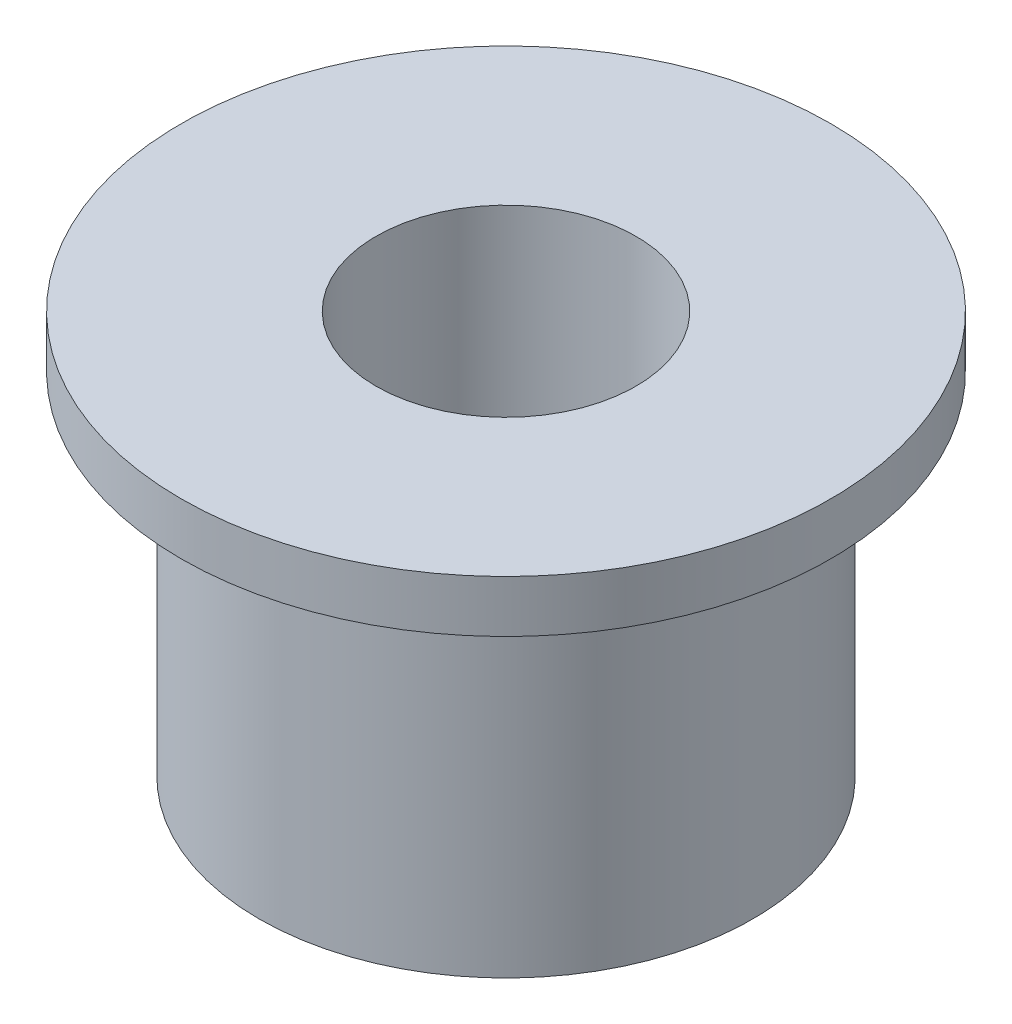
ISO-10303-21;
HEADER;
FILE_DESCRIPTION(('STEP AP214'),'2;1');
FILE_NAME('part.step','',(''),(''),'','','');
FILE_SCHEMA(('AUTOMOTIVE_DESIGN { 1 0 10303 214 1 1 1 1 }'));
ENDSEC;
DATA;
#1=APPLICATION_CONTEXT('core data for automotive mechanical design processes');
#2=APPLICATION_PROTOCOL_DEFINITION('international standard','automotive_design',2000,#1);
#3=PRODUCT_CONTEXT('',#1,'mechanical');
#4=PRODUCT('Part','Part','',(#3));
#5=PRODUCT_RELATED_PRODUCT_CATEGORY('part','',(#4));
#6=PRODUCT_DEFINITION_FORMATION('','',#4);
#7=PRODUCT_DEFINITION_CONTEXT('part definition',#1,'design');
#8=PRODUCT_DEFINITION('design','',#6,#7);
#9=PRODUCT_DEFINITION_SHAPE('','',#8);
#10=(LENGTH_UNIT() NAMED_UNIT(*) SI_UNIT(.MILLI.,.METRE.));
#11=(NAMED_UNIT(*) PLANE_ANGLE_UNIT() SI_UNIT($,.RADIAN.));
#12=(NAMED_UNIT(*) SI_UNIT($,.STERADIAN.) SOLID_ANGLE_UNIT());
#13=UNCERTAINTY_MEASURE_WITH_UNIT(LENGTH_MEASURE(1.E-05),#10,'distance_accuracy_value','');
#14=(GEOMETRIC_REPRESENTATION_CONTEXT(3) GLOBAL_UNCERTAINTY_ASSIGNED_CONTEXT((#13)) GLOBAL_UNIT_ASSIGNED_CONTEXT((#10,
#11,#12)) REPRESENTATION_CONTEXT('',''));
#15=CARTESIAN_POINT('',(0.,0.,0.));
#16=DIRECTION('',(0.,0.,1.));
#17=DIRECTION('',(1.,0.,0.));
#18=AXIS2_PLACEMENT_3D('',#15,#16,#17);
#19=CARTESIAN_POINT('',(0.,-4.,0.));
#20=DIRECTION('',(0.,1.,0.));
#21=DIRECTION('',(0.,0.,1.));
#22=AXIS2_PLACEMENT_3D('',#19,#20,#21);
#23=CYLINDRICAL_SURFACE('',#22,25.);
#24=CARTESIAN_POINT('',(0.,-4.,0.));
#25=DIRECTION('',(0.,1.,0.));
#26=DIRECTION('',(0.,0.,1.));
#27=AXIS2_PLACEMENT_3D('',#24,#25,#26);
#28=CIRCLE('',#27,25.);
#29=CARTESIAN_POINT('',(0.,-4.,25.));
#30=VERTEX_POINT('',#29);
#31=EDGE_CURVE('E10',#30,#30,#28,.T.);
#32=ORIENTED_EDGE('',*,*,#31,.T.);
#33=EDGE_LOOP('',(#32));
#34=FACE_BOUND('',#33,.T.);
#35=CARTESIAN_POINT('',(0.,0.,0.));
#36=DIRECTION('',(0.,1.,0.));
#37=DIRECTION('',(0.,0.,1.));
#38=AXIS2_PLACEMENT_3D('',#35,#36,#37);
#39=CIRCLE('',#38,25.);
#40=CARTESIAN_POINT('',(0.,0.,25.));
#41=VERTEX_POINT('',#40);
#42=EDGE_CURVE('E44',#41,#41,#39,.T.);
#43=ORIENTED_EDGE('',*,*,#42,.F.);
#44=EDGE_LOOP('',(#43));
#45=FACE_BOUND('',#44,.T.);
#46=ADVANCED_FACE('F41',(#34,#45),#23,.T.);
#47=CARTESIAN_POINT('',(0.,-4.,0.));
#48=DIRECTION('',(0.,1.,0.));
#49=DIRECTION('',(0.,0.,1.));
#50=AXIS2_PLACEMENT_3D('',#47,#48,#49);
#51=PLANE('',#50);
#52=CARTESIAN_POINT('',(0.,-4.,0.));
#53=DIRECTION('',(0.,1.,0.));
#54=DIRECTION('',(0.,0.,1.));
#55=AXIS2_PLACEMENT_3D('',#52,#53,#54);
#56=CIRCLE('',#55,19.);
#57=CARTESIAN_POINT('',(0.,-4.,19.));
#58=VERTEX_POINT('',#57);
#59=EDGE_CURVE('E51',#58,#58,#56,.T.);
#60=ORIENTED_EDGE('',*,*,#59,.T.);
#61=EDGE_LOOP('',(#60));
#62=FACE_BOUND('',#61,.T.);
#63=ORIENTED_EDGE('',*,*,#31,.F.);
#64=EDGE_LOOP('',(#63));
#65=FACE_BOUND('',#64,.T.);
#66=ADVANCED_FACE('F77',(#62,#65),#51,.F.);
#67=CARTESIAN_POINT('',(0.,0.,0.));
#68=DIRECTION('',(0.,1.,0.));
#69=DIRECTION('',(0.,0.,1.));
#70=AXIS2_PLACEMENT_3D('',#67,#68,#69);
#71=PLANE('',#70);
#72=ORIENTED_EDGE('',*,*,#42,.T.);
#73=EDGE_LOOP('',(#72));
#74=FACE_BOUND('',#73,.T.);
#75=CARTESIAN_POINT('',(0.,0.,0.));
#76=DIRECTION('',(0.,1.,0.));
#77=DIRECTION('',(0.,0.,1.));
#78=AXIS2_PLACEMENT_3D('',#75,#76,#77);
#79=CIRCLE('',#78,10.);
#80=CARTESIAN_POINT('',(0.,0.,10.));
#81=VERTEX_POINT('',#80);
#82=EDGE_CURVE('E56',#81,#81,#79,.T.);
#83=ORIENTED_EDGE('',*,*,#82,.F.);
#84=EDGE_LOOP('',(#83));
#85=FACE_BOUND('',#84,.T.);
#86=ADVANCED_FACE('F75',(#74,#85),#71,.T.);
#87=CARTESIAN_POINT('',(0.,-31.,0.));
#88=DIRECTION('',(0.,1.,0.));
#89=DIRECTION('',(0.,0.,1.));
#90=AXIS2_PLACEMENT_3D('',#87,#88,#89);
#91=CYLINDRICAL_SURFACE('',#90,19.);
#92=CARTESIAN_POINT('',(0.,-31.,0.));
#93=DIRECTION('',(0.,1.,0.));
#94=DIRECTION('',(0.,0.,1.));
#95=AXIS2_PLACEMENT_3D('',#92,#93,#94);
#96=CIRCLE('',#95,19.);
#97=CARTESIAN_POINT('',(0.,-31.,19.));
#98=VERTEX_POINT('',#97);
#99=EDGE_CURVE('E55',#98,#98,#96,.T.);
#100=ORIENTED_EDGE('',*,*,#99,.T.);
#101=EDGE_LOOP('',(#100));
#102=FACE_BOUND('',#101,.T.);
#103=ORIENTED_EDGE('',*,*,#59,.F.);
#104=EDGE_LOOP('',(#103));
#105=FACE_BOUND('',#104,.T.);
#106=ADVANCED_FACE('F71',(#102,#105),#91,.T.);
#107=CARTESIAN_POINT('',(0.,-31.,0.));
#108=DIRECTION('',(0.,1.,0.));
#109=DIRECTION('',(0.,0.,1.));
#110=AXIS2_PLACEMENT_3D('',#107,#108,#109);
#111=CYLINDRICAL_SURFACE('',#110,10.);
#112=CARTESIAN_POINT('',(0.,-31.,0.));
#113=DIRECTION('',(0.,1.,0.));
#114=DIRECTION('',(0.,0.,1.));
#115=AXIS2_PLACEMENT_3D('',#112,#113,#114);
#116=CIRCLE('',#115,10.);
#117=CARTESIAN_POINT('',(0.,-31.,10.));
#118=VERTEX_POINT('',#117);
#119=EDGE_CURVE('E59',#118,#118,#116,.T.);
#120=ORIENTED_EDGE('',*,*,#119,.F.);
#121=EDGE_LOOP('',(#120));
#122=FACE_BOUND('',#121,.T.);
#123=ORIENTED_EDGE('',*,*,#82,.T.);
#124=EDGE_LOOP('',(#123));
#125=FACE_BOUND('',#124,.T.);
#126=ADVANCED_FACE('F68',(#122,#125),#111,.F.);
#127=CARTESIAN_POINT('',(0.,-31.,0.));
#128=DIRECTION('',(0.,1.,0.));
#129=DIRECTION('',(0.,0.,1.));
#130=AXIS2_PLACEMENT_3D('',#127,#128,#129);
#131=PLANE('',#130);
#132=ORIENTED_EDGE('',*,*,#119,.T.);
#133=EDGE_LOOP('',(#132));
#134=FACE_BOUND('',#133,.T.);
#135=ORIENTED_EDGE('',*,*,#99,.F.);
#136=EDGE_LOOP('',(#135));
#137=FACE_BOUND('',#136,.T.);
#138=ADVANCED_FACE('F65',(#134,#137),#131,.F.);
#139=CLOSED_SHELL('',(#46,#66,#86,#106,#126,#138));
#140=MANIFOLD_SOLID_BREP('B2',#139);
#141=ADVANCED_BREP_SHAPE_REPRESENTATION('',(#18,#140),#14);
#142=SHAPE_DEFINITION_REPRESENTATION(#9,#141);
ENDSEC;
END-ISO-10303-21;
